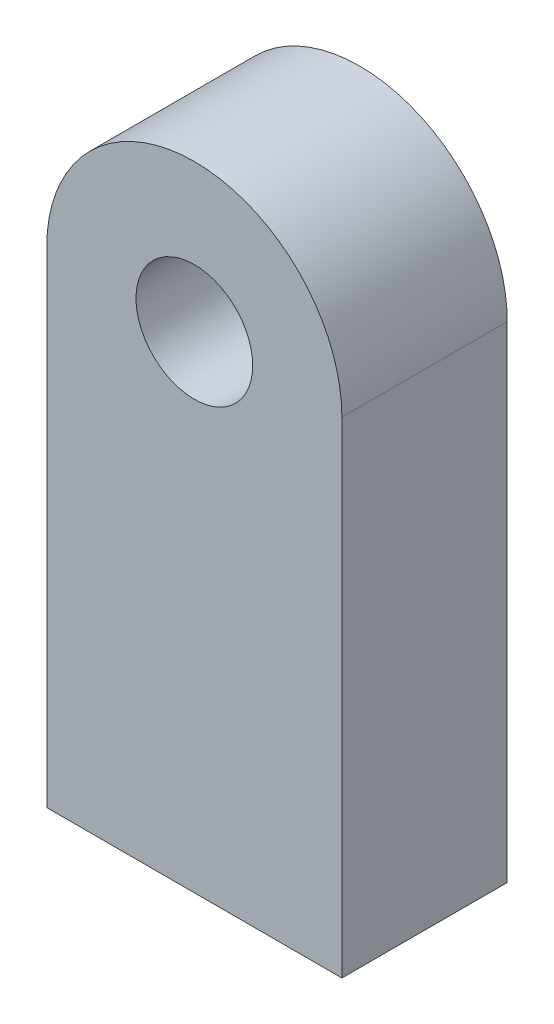
ISO-10303-21;
HEADER;
FILE_DESCRIPTION(('STEP AP214'),'2;1');
FILE_NAME('part.step','',(''),(''),'','','');
FILE_SCHEMA(('AUTOMOTIVE_DESIGN { 1 0 10303 214 1 1 1 1 }'));
ENDSEC;
DATA;
#1=APPLICATION_CONTEXT('core data for automotive mechanical design processes');
#2=APPLICATION_PROTOCOL_DEFINITION('international standard','automotive_design',2000,#1);
#3=PRODUCT_CONTEXT('',#1,'mechanical');
#4=PRODUCT('Part','Part','',(#3));
#5=PRODUCT_RELATED_PRODUCT_CATEGORY('part','',(#4));
#6=PRODUCT_DEFINITION_FORMATION('','',#4);
#7=PRODUCT_DEFINITION_CONTEXT('part definition',#1,'design');
#8=PRODUCT_DEFINITION('design','',#6,#7);
#9=PRODUCT_DEFINITION_SHAPE('','',#8);
#10=(LENGTH_UNIT() NAMED_UNIT(*) SI_UNIT(.MILLI.,.METRE.));
#11=(NAMED_UNIT(*) PLANE_ANGLE_UNIT() SI_UNIT($,.RADIAN.));
#12=(NAMED_UNIT(*) SI_UNIT($,.STERADIAN.) SOLID_ANGLE_UNIT());
#13=UNCERTAINTY_MEASURE_WITH_UNIT(LENGTH_MEASURE(1.E-05),#10,'distance_accuracy_value','');
#14=(GEOMETRIC_REPRESENTATION_CONTEXT(3) GLOBAL_UNCERTAINTY_ASSIGNED_CONTEXT((#13)) GLOBAL_UNIT_ASSIGNED_CONTEXT((#10,
#11,#12)) REPRESENTATION_CONTEXT('',''));
#15=CARTESIAN_POINT('',(0.,0.,0.));
#16=DIRECTION('',(0.,0.,1.));
#17=DIRECTION('',(1.,0.,0.));
#18=AXIS2_PLACEMENT_3D('',#15,#16,#17);
#19=CARTESIAN_POINT('',(0.,13.2198714824009,9.));
#20=DIRECTION('',(0.,0.,1.));
#21=DIRECTION('',(1.,0.,0.));
#22=AXIS2_PLACEMENT_3D('',#19,#20,#21);
#23=PLANE('',#22);
#24=DIRECTION('',(0.,1.,0.));
#25=VECTOR('',#24,1.);
#26=CARTESIAN_POINT('',(8.03278294434717,13.2198714824009,9.));
#27=LINE('',#26,#25);
#28=CARTESIAN_POINT('',(8.03278294434717,-13.2198714824009,9.));
#29=VERTEX_POINT('',#28);
#30=CARTESIAN_POINT('',(8.03278294434717,13.2198714824009,9.));
#31=VERTEX_POINT('',#30);
#32=EDGE_CURVE('E91',#29,#31,#27,.T.);
#33=ORIENTED_EDGE('',*,*,#32,.T.);
#34=CARTESIAN_POINT('',(0.,13.2198714824009,9.));
#35=DIRECTION('',(0.,0.,1.));
#36=DIRECTION('',(1.,0.,0.));
#37=AXIS2_PLACEMENT_3D('',#34,#35,#36);
#38=CIRCLE('',#37,8.03278294434717);
#39=CARTESIAN_POINT('',(-8.03278294434717,13.2198714824009,9.));
#40=VERTEX_POINT('',#39);
#41=EDGE_CURVE('E86',#31,#40,#38,.T.);
#42=ORIENTED_EDGE('',*,*,#41,.T.);
#43=DIRECTION('',(0.,-1.,0.));
#44=VECTOR('',#43,1.);
#45=CARTESIAN_POINT('',(-8.03278294434717,13.2198714824009,9.));
#46=LINE('',#45,#44);
#47=CARTESIAN_POINT('',(-8.03278294434717,-13.2198714824009,9.));
#48=VERTEX_POINT('',#47);
#49=EDGE_CURVE('E89',#40,#48,#46,.T.);
#50=ORIENTED_EDGE('',*,*,#49,.T.);
#51=DIRECTION('',(1.,0.,0.));
#52=VECTOR('',#51,1.);
#53=CARTESIAN_POINT('',(-8.03278294434717,-13.2198714824009,9.));
#54=LINE('',#53,#52);
#55=EDGE_CURVE('E56',#48,#29,#54,.T.);
#56=ORIENTED_EDGE('',*,*,#55,.T.);
#57=EDGE_LOOP('',(#33,#42,#50,#56));
#58=FACE_BOUND('',#57,.T.);
#59=CARTESIAN_POINT('',(0.,13.2198714824009,9.));
#60=DIRECTION('',(0.,0.,1.));
#61=DIRECTION('',(1.,0.,0.));
#62=AXIS2_PLACEMENT_3D('',#59,#60,#61);
#63=CIRCLE('',#62,3.175);
#64=CARTESIAN_POINT('',(3.175,13.2198714824009,9.));
#65=VERTEX_POINT('',#64);
#66=EDGE_CURVE('E106',#65,#65,#63,.T.);
#67=ORIENTED_EDGE('',*,*,#66,.F.);
#68=EDGE_LOOP('',(#67));
#69=FACE_BOUND('',#68,.T.);
#70=ADVANCED_FACE('F39',(#58,#69),#23,.T.);
#71=CARTESIAN_POINT('',(0.,13.2198714824009,0.));
#72=DIRECTION('',(0.,0.,1.));
#73=DIRECTION('',(1.,0.,0.));
#74=AXIS2_PLACEMENT_3D('',#71,#72,#73);
#75=PLANE('',#74);
#76=DIRECTION('',(0.,1.,0.));
#77=VECTOR('',#76,1.);
#78=CARTESIAN_POINT('',(8.03278294434717,13.2198714824009,0.));
#79=LINE('',#78,#77);
#80=CARTESIAN_POINT('',(8.03278294434717,-13.2198714824009,0.));
#81=VERTEX_POINT('',#80);
#82=CARTESIAN_POINT('',(8.03278294434717,13.2198714824009,0.));
#83=VERTEX_POINT('',#82);
#84=EDGE_CURVE('E103',#81,#83,#79,.T.);
#85=ORIENTED_EDGE('',*,*,#84,.F.);
#86=DIRECTION('',(1.,0.,0.));
#87=VECTOR('',#86,1.);
#88=CARTESIAN_POINT('',(-8.03278294434717,-13.2198714824009,0.));
#89=LINE('',#88,#87);
#90=CARTESIAN_POINT('',(-8.03278294434717,-13.2198714824009,0.));
#91=VERTEX_POINT('',#90);
#92=EDGE_CURVE('E79',#91,#81,#89,.T.);
#93=ORIENTED_EDGE('',*,*,#92,.F.);
#94=DIRECTION('',(0.,-1.,0.));
#95=VECTOR('',#94,1.);
#96=CARTESIAN_POINT('',(-8.03278294434717,13.2198714824009,0.));
#97=LINE('',#96,#95);
#98=CARTESIAN_POINT('',(-8.03278294434717,13.2198714824009,0.));
#99=VERTEX_POINT('',#98);
#100=EDGE_CURVE('E73',#99,#91,#97,.T.);
#101=ORIENTED_EDGE('',*,*,#100,.F.);
#102=CARTESIAN_POINT('',(0.,13.2198714824009,0.));
#103=DIRECTION('',(0.,0.,1.));
#104=DIRECTION('',(1.,0.,0.));
#105=AXIS2_PLACEMENT_3D('',#102,#103,#104);
#106=CIRCLE('',#105,8.03278294434717);
#107=EDGE_CURVE('E95',#83,#99,#106,.T.);
#108=ORIENTED_EDGE('',*,*,#107,.F.);
#109=EDGE_LOOP('',(#85,#93,#101,#108));
#110=FACE_BOUND('',#109,.T.);
#111=CARTESIAN_POINT('',(0.,13.2198714824009,0.));
#112=DIRECTION('',(0.,0.,1.));
#113=DIRECTION('',(1.,0.,0.));
#114=AXIS2_PLACEMENT_3D('',#111,#112,#113);
#115=CIRCLE('',#114,3.175);
#116=CARTESIAN_POINT('',(3.175,13.2198714824009,0.));
#117=VERTEX_POINT('',#116);
#118=EDGE_CURVE('E118',#117,#117,#115,.T.);
#119=ORIENTED_EDGE('',*,*,#118,.T.);
#120=EDGE_LOOP('',(#119));
#121=FACE_BOUND('',#120,.T.);
#122=ADVANCED_FACE('F114',(#110,#121),#75,.F.);
#123=CARTESIAN_POINT('',(8.03278294434717,13.2198714824009,9.));
#124=DIRECTION('',(-1.,0.,0.));
#125=DIRECTION('',(0.,0.,1.));
#126=AXIS2_PLACEMENT_3D('',#123,#124,#125);
#127=PLANE('',#126);
#128=ORIENTED_EDGE('',*,*,#84,.T.);
#129=DIRECTION('',(0.,0.,-1.));
#130=VECTOR('',#129,1.);
#131=CARTESIAN_POINT('',(8.03278294434717,13.2198714824009,9.));
#132=LINE('',#131,#130);
#133=EDGE_CURVE('E11',#31,#83,#132,.T.);
#134=ORIENTED_EDGE('',*,*,#133,.F.);
#135=ORIENTED_EDGE('',*,*,#32,.F.);
#136=DIRECTION('',(0.,0.,-1.));
#137=VECTOR('',#136,1.);
#138=CARTESIAN_POINT('',(8.03278294434717,-13.2198714824009,9.));
#139=LINE('',#138,#137);
#140=EDGE_CURVE('E99',#29,#81,#139,.T.);
#141=ORIENTED_EDGE('',*,*,#140,.T.);
#142=EDGE_LOOP('',(#128,#134,#135,#141));
#143=FACE_BOUND('',#142,.T.);
#144=ADVANCED_FACE('F41',(#143),#127,.F.);
#145=CARTESIAN_POINT('',(0.,13.2198714824009,9.));
#146=DIRECTION('',(0.,0.,-1.));
#147=DIRECTION('',(-1.,0.,0.));
#148=AXIS2_PLACEMENT_3D('',#145,#146,#147);
#149=CYLINDRICAL_SURFACE('',#148,8.03278294434717);
#150=ORIENTED_EDGE('',*,*,#107,.T.);
#151=DIRECTION('',(0.,0.,-1.));
#152=VECTOR('',#151,1.);
#153=CARTESIAN_POINT('',(-8.03278294434717,13.2198714824009,9.));
#154=LINE('',#153,#152);
#155=EDGE_CURVE('E48',#40,#99,#154,.T.);
#156=ORIENTED_EDGE('',*,*,#155,.F.);
#157=ORIENTED_EDGE('',*,*,#41,.F.);
#158=ORIENTED_EDGE('',*,*,#133,.T.);
#159=EDGE_LOOP('',(#150,#156,#157,#158));
#160=FACE_BOUND('',#159,.T.);
#161=ADVANCED_FACE('F94',(#160),#149,.T.);
#162=CARTESIAN_POINT('',(-8.03278294434717,13.2198714824009,9.));
#163=DIRECTION('',(1.,0.,0.));
#164=DIRECTION('',(0.,0.,-1.));
#165=AXIS2_PLACEMENT_3D('',#162,#163,#164);
#166=PLANE('',#165);
#167=ORIENTED_EDGE('',*,*,#100,.T.);
#168=DIRECTION('',(0.,0.,-1.));
#169=VECTOR('',#168,1.);
#170=CARTESIAN_POINT('',(-8.03278294434717,-13.2198714824009,9.));
#171=LINE('',#170,#169);
#172=EDGE_CURVE('E96',#48,#91,#171,.T.);
#173=ORIENTED_EDGE('',*,*,#172,.F.);
#174=ORIENTED_EDGE('',*,*,#49,.F.);
#175=ORIENTED_EDGE('',*,*,#155,.T.);
#176=EDGE_LOOP('',(#167,#173,#174,#175));
#177=FACE_BOUND('',#176,.T.);
#178=ADVANCED_FACE('F97',(#177),#166,.F.);
#179=CARTESIAN_POINT('',(-8.03278294434717,-13.2198714824009,9.));
#180=DIRECTION('',(0.,1.,0.));
#181=DIRECTION('',(0.,0.,1.));
#182=AXIS2_PLACEMENT_3D('',#179,#180,#181);
#183=PLANE('',#182);
#184=ORIENTED_EDGE('',*,*,#92,.T.);
#185=ORIENTED_EDGE('',*,*,#140,.F.);
#186=ORIENTED_EDGE('',*,*,#55,.F.);
#187=ORIENTED_EDGE('',*,*,#172,.T.);
#188=EDGE_LOOP('',(#184,#185,#186,#187));
#189=FACE_BOUND('',#188,.T.);
#190=ADVANCED_FACE('F111',(#189),#183,.F.);
#191=CARTESIAN_POINT('',(0.,13.2198714824009,9.));
#192=DIRECTION('',(0.,0.,-1.));
#193=DIRECTION('',(-1.,0.,0.));
#194=AXIS2_PLACEMENT_3D('',#191,#192,#193);
#195=CYLINDRICAL_SURFACE('',#194,3.175);
#196=ORIENTED_EDGE('',*,*,#66,.T.);
#197=EDGE_LOOP('',(#196));
#198=FACE_BOUND('',#197,.T.);
#199=ORIENTED_EDGE('',*,*,#118,.F.);
#200=EDGE_LOOP('',(#199));
#201=FACE_BOUND('',#200,.T.);
#202=ADVANCED_FACE('F124',(#198,#201),#195,.F.);
#203=CLOSED_SHELL('',(#70,#122,#144,#161,#178,#190,#202));
#204=MANIFOLD_SOLID_BREP('B2',#203);
#205=ADVANCED_BREP_SHAPE_REPRESENTATION('',(#18,#204),#14);
#206=SHAPE_DEFINITION_REPRESENTATION(#9,#205);
ENDSEC;
END-ISO-10303-21;
